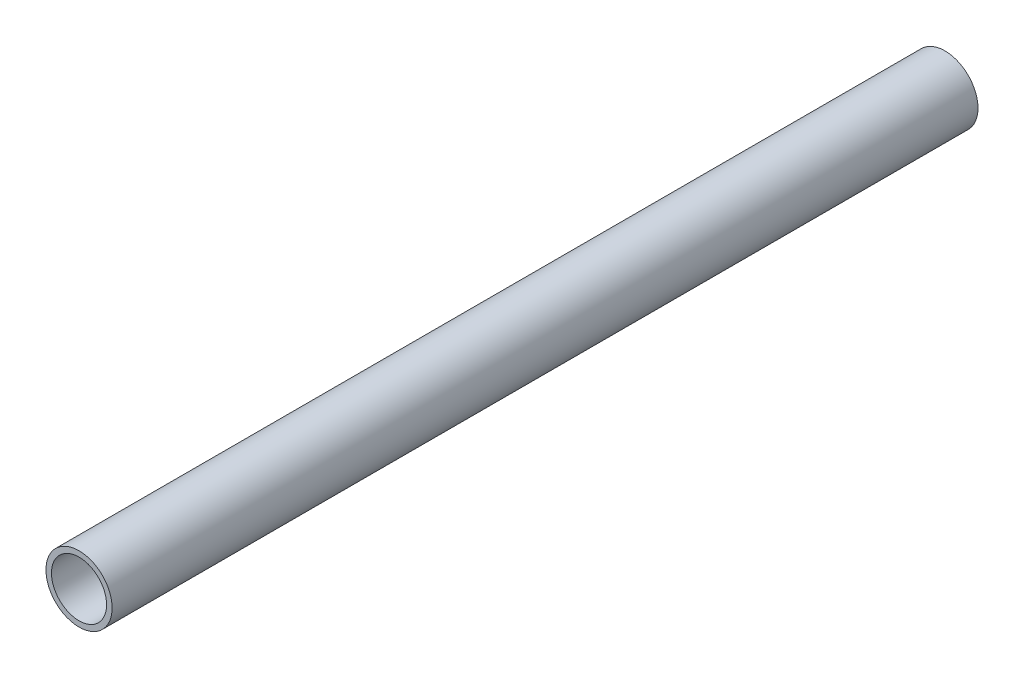
ISO-10303-21;
HEADER;
FILE_DESCRIPTION(('STEP AP214'),'2;1');
FILE_NAME('part.step','',(''),(''),'','','');
FILE_SCHEMA(('AUTOMOTIVE_DESIGN { 1 0 10303 214 1 1 1 1 }'));
ENDSEC;
DATA;
#1=APPLICATION_CONTEXT('core data for automotive mechanical design processes');
#2=APPLICATION_PROTOCOL_DEFINITION('international standard','automotive_design',2000,#1);
#3=PRODUCT_CONTEXT('',#1,'mechanical');
#4=PRODUCT('Part','Part','',(#3));
#5=PRODUCT_RELATED_PRODUCT_CATEGORY('part','',(#4));
#6=PRODUCT_DEFINITION_FORMATION('','',#4);
#7=PRODUCT_DEFINITION_CONTEXT('part definition',#1,'design');
#8=PRODUCT_DEFINITION('design','',#6,#7);
#9=PRODUCT_DEFINITION_SHAPE('','',#8);
#10=(LENGTH_UNIT() NAMED_UNIT(*) SI_UNIT(.MILLI.,.METRE.));
#11=(NAMED_UNIT(*) PLANE_ANGLE_UNIT() SI_UNIT($,.RADIAN.));
#12=(NAMED_UNIT(*) SI_UNIT($,.STERADIAN.) SOLID_ANGLE_UNIT());
#13=UNCERTAINTY_MEASURE_WITH_UNIT(LENGTH_MEASURE(1.E-05),#10,'distance_accuracy_value','');
#14=(GEOMETRIC_REPRESENTATION_CONTEXT(3) GLOBAL_UNCERTAINTY_ASSIGNED_CONTEXT((#13)) GLOBAL_UNIT_ASSIGNED_CONTEXT((#10,
#11,#12)) REPRESENTATION_CONTEXT('',''));
#15=CARTESIAN_POINT('',(0.,0.,0.));
#16=DIRECTION('',(0.,0.,1.));
#17=DIRECTION('',(1.,0.,0.));
#18=AXIS2_PLACEMENT_3D('',#15,#16,#17);
#19=CARTESIAN_POINT('',(0.,0.,157.));
#20=DIRECTION('',(0.,0.,1.));
#21=DIRECTION('',(1.,0.,0.));
#22=AXIS2_PLACEMENT_3D('',#19,#20,#21);
#23=PLANE('',#22);
#24=CARTESIAN_POINT('',(0.,0.,157.));
#25=DIRECTION('',(0.,0.,1.));
#26=DIRECTION('',(1.,0.,0.));
#27=AXIS2_PLACEMENT_3D('',#24,#25,#26);
#28=CIRCLE('',#27,6.);
#29=CARTESIAN_POINT('',(6.,0.,157.));
#30=VERTEX_POINT('',#29);
#31=EDGE_CURVE('E10',#30,#30,#28,.T.);
#32=ORIENTED_EDGE('',*,*,#31,.T.);
#33=EDGE_LOOP('',(#32));
#34=FACE_BOUND('',#33,.T.);
#35=CARTESIAN_POINT('',(0.,0.,157.));
#36=DIRECTION('',(0.,0.,1.));
#37=DIRECTION('',(1.,0.,0.));
#38=AXIS2_PLACEMENT_3D('',#35,#36,#37);
#39=CIRCLE('',#38,5.);
#40=CARTESIAN_POINT('',(5.,0.,157.));
#41=VERTEX_POINT('',#40);
#42=EDGE_CURVE('E41',#41,#41,#39,.T.);
#43=ORIENTED_EDGE('',*,*,#42,.F.);
#44=EDGE_LOOP('',(#43));
#45=FACE_BOUND('',#44,.T.);
#46=ADVANCED_FACE('F30',(#34,#45),#23,.T.);
#47=CARTESIAN_POINT('',(0.,0.,0.));
#48=DIRECTION('',(0.,0.,1.));
#49=DIRECTION('',(1.,0.,0.));
#50=AXIS2_PLACEMENT_3D('',#47,#48,#49);
#51=PLANE('',#50);
#52=CARTESIAN_POINT('',(0.,0.,0.));
#53=DIRECTION('',(0.,0.,1.));
#54=DIRECTION('',(1.,0.,0.));
#55=AXIS2_PLACEMENT_3D('',#52,#53,#54);
#56=CIRCLE('',#55,6.);
#57=CARTESIAN_POINT('',(6.,0.,0.));
#58=VERTEX_POINT('',#57);
#59=EDGE_CURVE('E34',#58,#58,#56,.T.);
#60=ORIENTED_EDGE('',*,*,#59,.F.);
#61=EDGE_LOOP('',(#60));
#62=FACE_BOUND('',#61,.T.);
#63=CARTESIAN_POINT('',(0.,0.,0.));
#64=DIRECTION('',(0.,0.,1.));
#65=DIRECTION('',(1.,0.,0.));
#66=AXIS2_PLACEMENT_3D('',#63,#64,#65);
#67=CIRCLE('',#66,5.);
#68=CARTESIAN_POINT('',(5.,0.,0.));
#69=VERTEX_POINT('',#68);
#70=EDGE_CURVE('E43',#69,#69,#67,.T.);
#71=ORIENTED_EDGE('',*,*,#70,.T.);
#72=EDGE_LOOP('',(#71));
#73=FACE_BOUND('',#72,.T.);
#74=ADVANCED_FACE('F53',(#62,#73),#51,.F.);
#75=CARTESIAN_POINT('',(0.,0.,157.));
#76=DIRECTION('',(0.,0.,-1.));
#77=DIRECTION('',(-1.,0.,0.));
#78=AXIS2_PLACEMENT_3D('',#75,#76,#77);
#79=CYLINDRICAL_SURFACE('',#78,6.);
#80=ORIENTED_EDGE('',*,*,#31,.F.);
#81=EDGE_LOOP('',(#80));
#82=FACE_BOUND('',#81,.T.);
#83=ORIENTED_EDGE('',*,*,#59,.T.);
#84=EDGE_LOOP('',(#83));
#85=FACE_BOUND('',#84,.T.);
#86=ADVANCED_FACE('F32',(#82,#85),#79,.T.);
#87=CARTESIAN_POINT('',(0.,0.,157.));
#88=DIRECTION('',(0.,0.,-1.));
#89=DIRECTION('',(-1.,0.,0.));
#90=AXIS2_PLACEMENT_3D('',#87,#88,#89);
#91=CYLINDRICAL_SURFACE('',#90,5.);
#92=ORIENTED_EDGE('',*,*,#42,.T.);
#93=EDGE_LOOP('',(#92));
#94=FACE_BOUND('',#93,.T.);
#95=ORIENTED_EDGE('',*,*,#70,.F.);
#96=EDGE_LOOP('',(#95));
#97=FACE_BOUND('',#96,.T.);
#98=ADVANCED_FACE('F49',(#94,#97),#91,.F.);
#99=CLOSED_SHELL('',(#46,#74,#86,#98));
#100=MANIFOLD_SOLID_BREP('B2',#99);
#101=ADVANCED_BREP_SHAPE_REPRESENTATION('',(#18,#100),#14);
#102=SHAPE_DEFINITION_REPRESENTATION(#9,#101);
ENDSEC;
END-ISO-10303-21;
